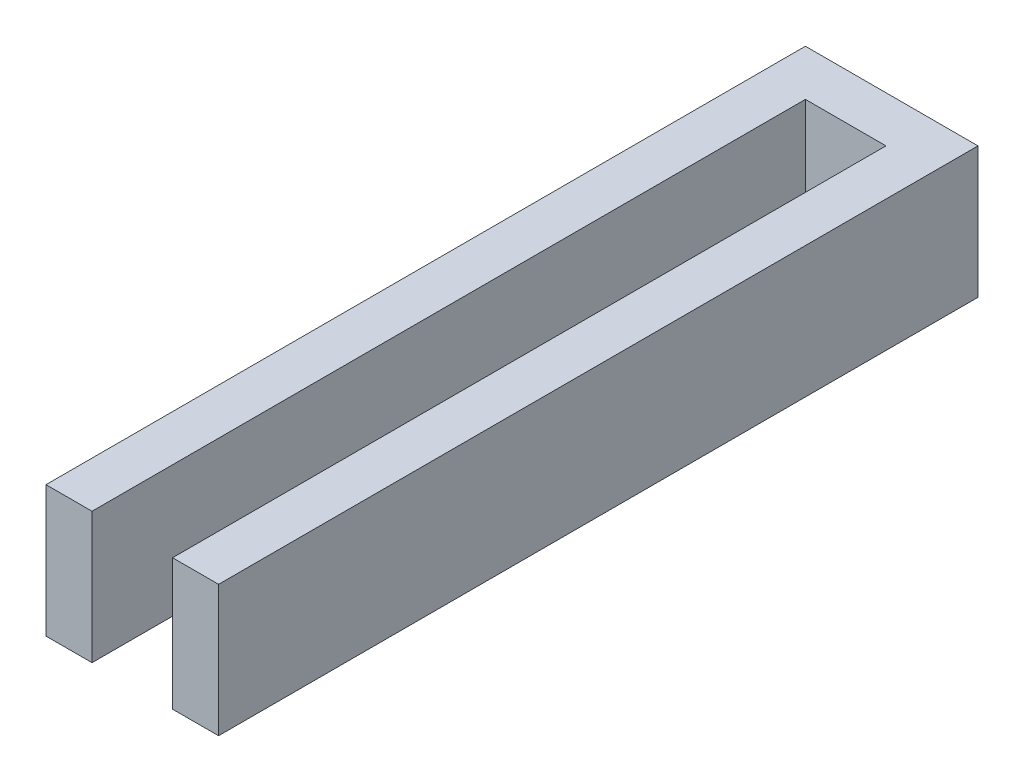
ISO-10303-21;
HEADER;
FILE_DESCRIPTION(('STEP AP214'),'2;1');
FILE_NAME('part.step','',(''),(''),'','','');
FILE_SCHEMA(('AUTOMOTIVE_DESIGN { 1 0 10303 214 1 1 1 1 }'));
ENDSEC;
DATA;
#1=APPLICATION_CONTEXT('core data for automotive mechanical design processes');
#2=APPLICATION_PROTOCOL_DEFINITION('international standard','automotive_design',2000,#1);
#3=PRODUCT_CONTEXT('',#1,'mechanical');
#4=PRODUCT('Part','Part','',(#3));
#5=PRODUCT_RELATED_PRODUCT_CATEGORY('part','',(#4));
#6=PRODUCT_DEFINITION_FORMATION('','',#4);
#7=PRODUCT_DEFINITION_CONTEXT('part definition',#1,'design');
#8=PRODUCT_DEFINITION('design','',#6,#7);
#9=PRODUCT_DEFINITION_SHAPE('','',#8);
#10=(LENGTH_UNIT() NAMED_UNIT(*) SI_UNIT(.MILLI.,.METRE.));
#11=(NAMED_UNIT(*) PLANE_ANGLE_UNIT() SI_UNIT($,.RADIAN.));
#12=(NAMED_UNIT(*) SI_UNIT($,.STERADIAN.) SOLID_ANGLE_UNIT());
#13=UNCERTAINTY_MEASURE_WITH_UNIT(LENGTH_MEASURE(1.E-05),#10,'distance_accuracy_value','');
#14=(GEOMETRIC_REPRESENTATION_CONTEXT(3) GLOBAL_UNCERTAINTY_ASSIGNED_CONTEXT((#13)) GLOBAL_UNIT_ASSIGNED_CONTEXT((#10,
#11,#12)) REPRESENTATION_CONTEXT('',''));
#15=CARTESIAN_POINT('',(0.,0.,0.));
#16=DIRECTION('',(0.,0.,1.));
#17=DIRECTION('',(1.,0.,0.));
#18=AXIS2_PLACEMENT_3D('',#15,#16,#17);
#19=CARTESIAN_POINT('',(0.,5.7,18.4600694444444));
#20=DIRECTION('',(0.,0.,-1.));
#21=DIRECTION('',(-1.,0.,0.));
#22=AXIS2_PLACEMENT_3D('',#19,#20,#21);
#23=PLANE('',#22);
#24=DIRECTION('',(1.,0.,0.));
#25=VECTOR('',#24,1.);
#26=CARTESIAN_POINT('',(0.,0.,18.4600694444444));
#27=LINE('',#26,#25);
#28=CARTESIAN_POINT('',(1.01215277777778,0.,18.4600694444444));
#29=VERTEX_POINT('',#28);
#30=CARTESIAN_POINT('',(3.01215277777777,0.,18.4600694444444));
#31=VERTEX_POINT('',#30);
#32=EDGE_CURVE('E142',#29,#31,#27,.T.);
#33=ORIENTED_EDGE('',*,*,#32,.T.);
#34=DIRECTION('',(0.,-1.,0.));
#35=VECTOR('',#34,1.);
#36=CARTESIAN_POINT('',(3.01215277777777,5.7,18.4600694444444));
#37=LINE('',#36,#35);
#38=CARTESIAN_POINT('',(3.01215277777777,5.7,18.4600694444444));
#39=VERTEX_POINT('',#38);
#40=EDGE_CURVE('E11',#39,#31,#37,.T.);
#41=ORIENTED_EDGE('',*,*,#40,.F.);
#42=DIRECTION('',(1.,0.,0.));
#43=VECTOR('',#42,1.);
#44=CARTESIAN_POINT('',(0.,5.7,18.4600694444444));
#45=LINE('',#44,#43);
#46=CARTESIAN_POINT('',(1.01215277777778,5.7,18.4600694444444));
#47=VERTEX_POINT('',#46);
#48=EDGE_CURVE('E166',#47,#39,#45,.T.);
#49=ORIENTED_EDGE('',*,*,#48,.F.);
#50=DIRECTION('',(0.,-1.,0.));
#51=VECTOR('',#50,1.);
#52=CARTESIAN_POINT('',(1.01215277777778,5.7,18.4600694444444));
#53=LINE('',#52,#51);
#54=EDGE_CURVE('E138',#47,#29,#53,.T.);
#55=ORIENTED_EDGE('',*,*,#54,.T.);
#56=EDGE_LOOP('',(#33,#41,#49,#55));
#57=FACE_BOUND('',#56,.T.);
#58=ADVANCED_FACE('F41',(#57),#23,.F.);
#59=CARTESIAN_POINT('',(3.01215277777777,5.7,0.));
#60=DIRECTION('',(-1.,0.,0.));
#61=DIRECTION('',(0.,0.,1.));
#62=AXIS2_PLACEMENT_3D('',#59,#60,#61);
#63=PLANE('',#62);
#64=DIRECTION('',(0.,0.,-1.));
#65=VECTOR('',#64,1.);
#66=CARTESIAN_POINT('',(3.01215277777777,0.,0.));
#67=LINE('',#66,#65);
#68=CARTESIAN_POINT('',(3.01215277777777,0.,-12.5399305555556));
#69=VERTEX_POINT('',#68);
#70=EDGE_CURVE('E146',#31,#69,#67,.T.);
#71=ORIENTED_EDGE('',*,*,#70,.T.);
#72=DIRECTION('',(0.,-1.,0.));
#73=VECTOR('',#72,1.);
#74=CARTESIAN_POINT('',(3.01215277777777,5.7,-12.5399305555556));
#75=LINE('',#74,#73);
#76=CARTESIAN_POINT('',(3.01215277777777,5.7,-12.5399305555556));
#77=VERTEX_POINT('',#76);
#78=EDGE_CURVE('E51',#77,#69,#75,.T.);
#79=ORIENTED_EDGE('',*,*,#78,.F.);
#80=DIRECTION('',(0.,0.,-1.));
#81=VECTOR('',#80,1.);
#82=CARTESIAN_POINT('',(3.01215277777777,5.7,0.));
#83=LINE('',#82,#81);
#84=EDGE_CURVE('E98',#39,#77,#83,.T.);
#85=ORIENTED_EDGE('',*,*,#84,.F.);
#86=ORIENTED_EDGE('',*,*,#40,.T.);
#87=EDGE_LOOP('',(#71,#79,#85,#86));
#88=FACE_BOUND('',#87,.T.);
#89=ADVANCED_FACE('F43',(#88),#63,.F.);
#90=CARTESIAN_POINT('',(0.,5.7,-12.5399305555556));
#91=DIRECTION('',(0.,0.,1.));
#92=DIRECTION('',(1.,0.,0.));
#93=AXIS2_PLACEMENT_3D('',#90,#91,#92);
#94=PLANE('',#93);
#95=DIRECTION('',(-1.,0.,0.));
#96=VECTOR('',#95,1.);
#97=CARTESIAN_POINT('',(0.,0.,-12.5399305555556));
#98=LINE('',#97,#96);
#99=CARTESIAN_POINT('',(6.51215277777778,0.,-12.5399305555556));
#100=VERTEX_POINT('',#99);
#101=EDGE_CURVE('E151',#100,#69,#98,.T.);
#102=ORIENTED_EDGE('',*,*,#101,.F.);
#103=DIRECTION('',(0.,-1.,0.));
#104=VECTOR('',#103,1.);
#105=CARTESIAN_POINT('',(6.51215277777778,5.7,-12.5399305555556));
#106=LINE('',#105,#104);
#107=CARTESIAN_POINT('',(6.51215277777778,5.7,-12.5399305555556));
#108=VERTEX_POINT('',#107);
#109=EDGE_CURVE('E176',#108,#100,#106,.T.);
#110=ORIENTED_EDGE('',*,*,#109,.F.);
#111=DIRECTION('',(-1.,0.,0.));
#112=VECTOR('',#111,1.);
#113=CARTESIAN_POINT('',(0.,5.7,-12.5399305555556));
#114=LINE('',#113,#112);
#115=EDGE_CURVE('E184',#108,#77,#114,.T.);
#116=ORIENTED_EDGE('',*,*,#115,.T.);
#117=ORIENTED_EDGE('',*,*,#78,.T.);
#118=EDGE_LOOP('',(#102,#110,#116,#117));
#119=FACE_BOUND('',#118,.T.);
#120=ADVANCED_FACE('F182',(#119),#94,.T.);
#121=CARTESIAN_POINT('',(6.51215277777778,5.7,0.));
#122=DIRECTION('',(-1.,0.,0.));
#123=DIRECTION('',(0.,0.,1.));
#124=AXIS2_PLACEMENT_3D('',#121,#122,#123);
#125=PLANE('',#124);
#126=DIRECTION('',(0.,0.,-1.));
#127=VECTOR('',#126,1.);
#128=CARTESIAN_POINT('',(6.51215277777778,0.,0.));
#129=LINE('',#128,#127);
#130=CARTESIAN_POINT('',(6.51215277777778,0.,18.4600694444445));
#131=VERTEX_POINT('',#130);
#132=EDGE_CURVE('E155',#131,#100,#129,.T.);
#133=ORIENTED_EDGE('',*,*,#132,.F.);
#134=DIRECTION('',(0.,-1.,0.));
#135=VECTOR('',#134,1.);
#136=CARTESIAN_POINT('',(6.51215277777778,5.7,18.4600694444445));
#137=LINE('',#136,#135);
#138=CARTESIAN_POINT('',(6.51215277777778,5.7,18.4600694444445));
#139=VERTEX_POINT('',#138);
#140=EDGE_CURVE('E173',#139,#131,#137,.T.);
#141=ORIENTED_EDGE('',*,*,#140,.F.);
#142=DIRECTION('',(0.,0.,-1.));
#143=VECTOR('',#142,1.);
#144=CARTESIAN_POINT('',(6.51215277777778,5.7,0.));
#145=LINE('',#144,#143);
#146=EDGE_CURVE('E195',#139,#108,#145,.T.);
#147=ORIENTED_EDGE('',*,*,#146,.T.);
#148=ORIENTED_EDGE('',*,*,#109,.T.);
#149=EDGE_LOOP('',(#133,#141,#147,#148));
#150=FACE_BOUND('',#149,.T.);
#151=ADVANCED_FACE('F193',(#150),#125,.T.);
#152=CARTESIAN_POINT('',(8.51215277777778,0.,18.4600694444445));
#153=VERTEX_POINT('',#152);
#154=EDGE_CURVE('E147',#131,#153,#27,.T.);
#155=ORIENTED_EDGE('',*,*,#154,.T.);
#156=DIRECTION('',(0.,-1.,0.));
#157=VECTOR('',#156,1.);
#158=CARTESIAN_POINT('',(8.51215277777778,5.7,18.4600694444445));
#159=LINE('',#158,#157);
#160=CARTESIAN_POINT('',(8.51215277777778,5.7,18.4600694444445));
#161=VERTEX_POINT('',#160);
#162=EDGE_CURVE('E124',#161,#153,#159,.T.);
#163=ORIENTED_EDGE('',*,*,#162,.F.);
#164=EDGE_CURVE('E130',#139,#161,#45,.T.);
#165=ORIENTED_EDGE('',*,*,#164,.F.);
#166=ORIENTED_EDGE('',*,*,#140,.T.);
#167=EDGE_LOOP('',(#155,#163,#165,#166));
#168=FACE_BOUND('',#167,.T.);
#169=ADVANCED_FACE('F218',(#168),#23,.F.);
#170=CARTESIAN_POINT('',(8.51215277777778,5.7,0.));
#171=DIRECTION('',(1.,0.,0.));
#172=DIRECTION('',(0.,0.,-1.));
#173=AXIS2_PLACEMENT_3D('',#170,#171,#172);
#174=PLANE('',#173);
#175=DIRECTION('',(0.,0.,1.));
#176=VECTOR('',#175,1.);
#177=CARTESIAN_POINT('',(8.51215277777778,0.,0.));
#178=LINE('',#177,#176);
#179=CARTESIAN_POINT('',(8.51215277777778,0.,-14.5399305555556));
#180=VERTEX_POINT('',#179);
#181=EDGE_CURVE('E118',#180,#153,#178,.T.);
#182=ORIENTED_EDGE('',*,*,#181,.F.);
#183=DIRECTION('',(0.,-1.,0.));
#184=VECTOR('',#183,1.);
#185=CARTESIAN_POINT('',(8.51215277777778,5.7,-14.5399305555556));
#186=LINE('',#185,#184);
#187=CARTESIAN_POINT('',(8.51215277777778,5.7,-14.5399305555556));
#188=VERTEX_POINT('',#187);
#189=EDGE_CURVE('E113',#188,#180,#186,.T.);
#190=ORIENTED_EDGE('',*,*,#189,.F.);
#191=DIRECTION('',(0.,0.,1.));
#192=VECTOR('',#191,1.);
#193=CARTESIAN_POINT('',(8.51215277777778,5.7,0.));
#194=LINE('',#193,#192);
#195=EDGE_CURVE('E116',#188,#161,#194,.T.);
#196=ORIENTED_EDGE('',*,*,#195,.T.);
#197=ORIENTED_EDGE('',*,*,#162,.T.);
#198=EDGE_LOOP('',(#182,#190,#196,#197));
#199=FACE_BOUND('',#198,.T.);
#200=ADVANCED_FACE('F115',(#199),#174,.T.);
#201=CARTESIAN_POINT('',(0.,5.7,-14.5399305555556));
#202=DIRECTION('',(0.,0.,-1.));
#203=DIRECTION('',(-1.,0.,0.));
#204=AXIS2_PLACEMENT_3D('',#201,#202,#203);
#205=PLANE('',#204);
#206=DIRECTION('',(1.,0.,0.));
#207=VECTOR('',#206,1.);
#208=CARTESIAN_POINT('',(0.,0.,-14.5399305555556));
#209=LINE('',#208,#207);
#210=CARTESIAN_POINT('',(1.01215277777777,0.,-14.5399305555556));
#211=VERTEX_POINT('',#210);
#212=EDGE_CURVE('E161',#211,#180,#209,.T.);
#213=ORIENTED_EDGE('',*,*,#212,.F.);
#214=DIRECTION('',(0.,-1.,0.));
#215=VECTOR('',#214,1.);
#216=CARTESIAN_POINT('',(1.01215277777777,5.7,-14.5399305555556));
#217=LINE('',#216,#215);
#218=CARTESIAN_POINT('',(1.01215277777777,5.7,-14.5399305555556));
#219=VERTEX_POINT('',#218);
#220=EDGE_CURVE('E87',#219,#211,#217,.T.);
#221=ORIENTED_EDGE('',*,*,#220,.F.);
#222=DIRECTION('',(1.,0.,0.));
#223=VECTOR('',#222,1.);
#224=CARTESIAN_POINT('',(0.,5.7,-14.5399305555556));
#225=LINE('',#224,#223);
#226=EDGE_CURVE('E127',#219,#188,#225,.T.);
#227=ORIENTED_EDGE('',*,*,#226,.T.);
#228=ORIENTED_EDGE('',*,*,#189,.T.);
#229=EDGE_LOOP('',(#213,#221,#227,#228));
#230=FACE_BOUND('',#229,.T.);
#231=ADVANCED_FACE('F134',(#230),#205,.T.);
#232=CARTESIAN_POINT('',(1.01215277777778,5.7,0.));
#233=DIRECTION('',(1.,0.,0.));
#234=DIRECTION('',(0.,0.,-1.));
#235=AXIS2_PLACEMENT_3D('',#232,#233,#234);
#236=PLANE('',#235);
#237=DIRECTION('',(0.,0.,1.));
#238=VECTOR('',#237,1.);
#239=CARTESIAN_POINT('',(1.01215277777778,0.,0.));
#240=LINE('',#239,#238);
#241=EDGE_CURVE('E90',#211,#29,#240,.T.);
#242=ORIENTED_EDGE('',*,*,#241,.T.);
#243=ORIENTED_EDGE('',*,*,#54,.F.);
#244=DIRECTION('',(0.,0.,1.));
#245=VECTOR('',#244,1.);
#246=CARTESIAN_POINT('',(1.01215277777778,5.7,0.));
#247=LINE('',#246,#245);
#248=EDGE_CURVE('E59',#219,#47,#247,.T.);
#249=ORIENTED_EDGE('',*,*,#248,.F.);
#250=ORIENTED_EDGE('',*,*,#220,.T.);
#251=EDGE_LOOP('',(#242,#243,#249,#250));
#252=FACE_BOUND('',#251,.T.);
#253=ADVANCED_FACE('F206',(#252),#236,.F.);
#254=CARTESIAN_POINT('',(0.,5.7,0.));
#255=DIRECTION('',(0.,1.,0.));
#256=DIRECTION('',(0.,0.,1.));
#257=AXIS2_PLACEMENT_3D('',#254,#255,#256);
#258=PLANE('',#257);
#259=ORIENTED_EDGE('',*,*,#48,.T.);
#260=ORIENTED_EDGE('',*,*,#84,.T.);
#261=ORIENTED_EDGE('',*,*,#115,.F.);
#262=ORIENTED_EDGE('',*,*,#146,.F.);
#263=ORIENTED_EDGE('',*,*,#164,.T.);
#264=ORIENTED_EDGE('',*,*,#195,.F.);
#265=ORIENTED_EDGE('',*,*,#226,.F.);
#266=ORIENTED_EDGE('',*,*,#248,.T.);
#267=EDGE_LOOP('',(#259,#260,#261,#262,#263,#264,#265,#266));
#268=FACE_BOUND('',#267,.T.);
#269=ADVANCED_FACE('F126',(#268),#258,.T.);
#270=CARTESIAN_POINT('',(0.,0.,0.));
#271=DIRECTION('',(0.,1.,0.));
#272=DIRECTION('',(0.,0.,1.));
#273=AXIS2_PLACEMENT_3D('',#270,#271,#272);
#274=PLANE('',#273);
#275=ORIENTED_EDGE('',*,*,#32,.F.);
#276=ORIENTED_EDGE('',*,*,#241,.F.);
#277=ORIENTED_EDGE('',*,*,#212,.T.);
#278=ORIENTED_EDGE('',*,*,#181,.T.);
#279=ORIENTED_EDGE('',*,*,#154,.F.);
#280=ORIENTED_EDGE('',*,*,#132,.T.);
#281=ORIENTED_EDGE('',*,*,#101,.T.);
#282=ORIENTED_EDGE('',*,*,#70,.F.);
#283=EDGE_LOOP('',(#275,#276,#277,#278,#279,#280,#281,#282));
#284=FACE_BOUND('',#283,.T.);
#285=ADVANCED_FACE('F188',(#284),#274,.F.);
#286=CLOSED_SHELL('',(#58,#89,#120,#151,#169,#200,#231,#253,#269,#285));
#287=MANIFOLD_SOLID_BREP('B2',#286);
#288=ADVANCED_BREP_SHAPE_REPRESENTATION('',(#18,#287),#14);
#289=SHAPE_DEFINITION_REPRESENTATION(#9,#288);
ENDSEC;
END-ISO-10303-21;
